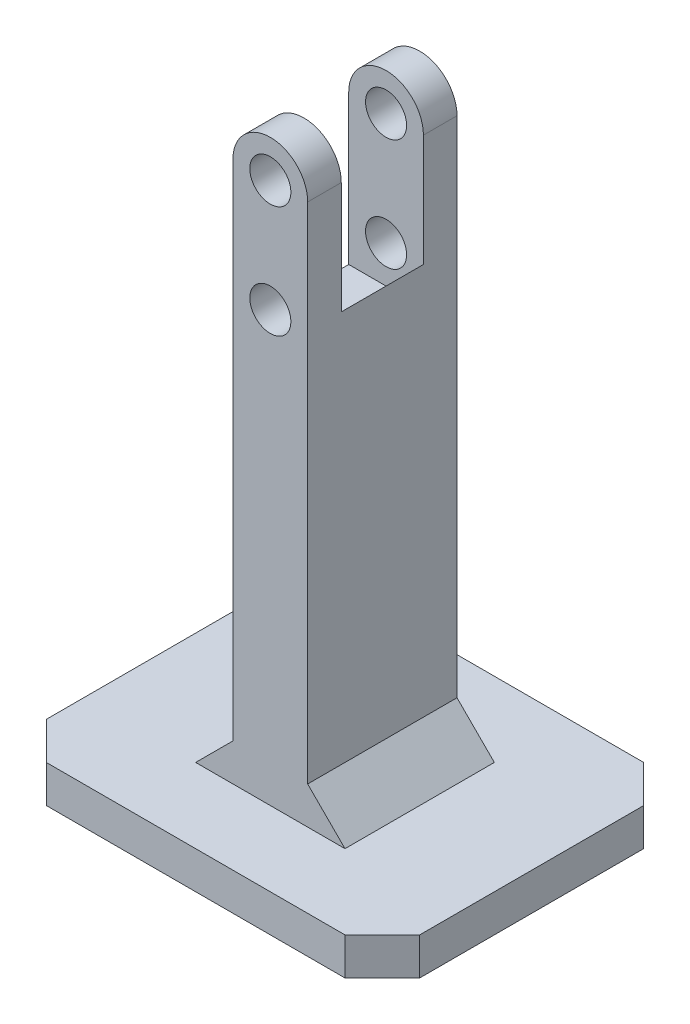
ISO-10303-21;
HEADER;
FILE_DESCRIPTION(('STEP AP214'),'2;1');
FILE_NAME('part.step','',(''),(''),'','','');
FILE_SCHEMA(('AUTOMOTIVE_DESIGN { 1 0 10303 214 1 1 1 1 }'));
ENDSEC;
DATA;
#1=APPLICATION_CONTEXT('core data for automotive mechanical design processes');
#2=APPLICATION_PROTOCOL_DEFINITION('international standard','automotive_design',2000,#1);
#3=PRODUCT_CONTEXT('',#1,'mechanical');
#4=PRODUCT('Part','Part','',(#3));
#5=PRODUCT_RELATED_PRODUCT_CATEGORY('part','',(#4));
#6=PRODUCT_DEFINITION_FORMATION('','',#4);
#7=PRODUCT_DEFINITION_CONTEXT('part definition',#1,'design');
#8=PRODUCT_DEFINITION('design','',#6,#7);
#9=PRODUCT_DEFINITION_SHAPE('','',#8);
#10=(LENGTH_UNIT() NAMED_UNIT(*) SI_UNIT(.MILLI.,.METRE.));
#11=(NAMED_UNIT(*) PLANE_ANGLE_UNIT() SI_UNIT($,.RADIAN.));
#12=(NAMED_UNIT(*) SI_UNIT($,.STERADIAN.) SOLID_ANGLE_UNIT());
#13=UNCERTAINTY_MEASURE_WITH_UNIT(LENGTH_MEASURE(1.E-05),#10,'distance_accuracy_value','');
#14=(GEOMETRIC_REPRESENTATION_CONTEXT(3) GLOBAL_UNCERTAINTY_ASSIGNED_CONTEXT((#13)) GLOBAL_UNIT_ASSIGNED_CONTEXT((#10,
#11,#12)) REPRESENTATION_CONTEXT('',''));
#15=CARTESIAN_POINT('',(0.,0.,0.));
#16=DIRECTION('',(0.,0.,1.));
#17=DIRECTION('',(1.,0.,0.));
#18=AXIS2_PLACEMENT_3D('',#15,#16,#17);
#19=CARTESIAN_POINT('',(5.,0.,10.));
#20=DIRECTION('',(-1.,0.,0.));
#21=DIRECTION('',(0.,-1.,0.));
#22=AXIS2_PLACEMENT_3D('',#19,#20,#21);
#23=PLANE('',#22);
#24=DIRECTION('',(0.,1.,0.));
#25=VECTOR('',#24,1.);
#26=CARTESIAN_POINT('',(5.,0.,10.));
#27=LINE('',#26,#25);
#28=CARTESIAN_POINT('',(5.,-60.,10.));
#29=VERTEX_POINT('',#28);
#30=CARTESIAN_POINT('',(5.,7.5,10.));
#31=VERTEX_POINT('',#30);
#32=EDGE_CURVE('E248',#29,#31,#27,.T.);
#33=ORIENTED_EDGE('',*,*,#32,.F.);
#34=DIRECTION('',(0.,0.,-1.));
#35=VECTOR('',#34,1.);
#36=CARTESIAN_POINT('',(5.,-60.,10.));
#37=LINE('',#36,#35);
#38=CARTESIAN_POINT('',(5.,-60.,-10.));
#39=VERTEX_POINT('',#38);
#40=EDGE_CURVE('E287',#29,#39,#37,.T.);
#41=ORIENTED_EDGE('',*,*,#40,.T.);
#42=DIRECTION('',(0.,1.,0.));
#43=VECTOR('',#42,1.);
#44=CARTESIAN_POINT('',(5.,0.,-10.));
#45=LINE('',#44,#43);
#46=CARTESIAN_POINT('',(5.,7.5,-10.));
#47=VERTEX_POINT('',#46);
#48=EDGE_CURVE('E247',#39,#47,#45,.T.);
#49=ORIENTED_EDGE('',*,*,#48,.T.);
#50=DIRECTION('',(0.,0.,-1.));
#51=VECTOR('',#50,1.);
#52=CARTESIAN_POINT('',(5.,7.5,10.));
#53=LINE('',#52,#51);
#54=CARTESIAN_POINT('',(5.,7.5,-5.5));
#55=VERTEX_POINT('',#54);
#56=EDGE_CURVE('E203',#55,#47,#53,.T.);
#57=ORIENTED_EDGE('',*,*,#56,.F.);
#58=DIRECTION('',(0.,1.,0.));
#59=VECTOR('',#58,1.);
#60=CARTESIAN_POINT('',(5.,0.,-5.5));
#61=LINE('',#60,#59);
#62=CARTESIAN_POINT('',(5.,-7.5,-5.5));
#63=VERTEX_POINT('',#62);
#64=EDGE_CURVE('E195',#63,#55,#61,.T.);
#65=ORIENTED_EDGE('',*,*,#64,.F.);
#66=DIRECTION('',(0.,0.,1.));
#67=VECTOR('',#66,1.);
#68=CARTESIAN_POINT('',(5.,-7.5,-5.5));
#69=LINE('',#68,#67);
#70=CARTESIAN_POINT('',(5.,-7.5,5.5));
#71=VERTEX_POINT('',#70);
#72=EDGE_CURVE('E177',#63,#71,#69,.T.);
#73=ORIENTED_EDGE('',*,*,#72,.T.);
#74=DIRECTION('',(0.,1.,0.));
#75=VECTOR('',#74,1.);
#76=CARTESIAN_POINT('',(5.,0.,5.5));
#77=LINE('',#76,#75);
#78=CARTESIAN_POINT('',(5.,7.5,5.5));
#79=VERTEX_POINT('',#78);
#80=EDGE_CURVE('E213',#71,#79,#77,.T.);
#81=ORIENTED_EDGE('',*,*,#80,.T.);
#82=EDGE_CURVE('E278',#31,#79,#53,.T.);
#83=ORIENTED_EDGE('',*,*,#82,.F.);
#84=EDGE_LOOP('',(#33,#41,#49,#57,#65,#73,#81,#83));
#85=FACE_BOUND('',#84,.T.);
#86=ADVANCED_FACE('F43',(#85),#23,.F.);
#87=CARTESIAN_POINT('',(0.,7.5,10.));
#88=DIRECTION('',(0.,0.,-1.));
#89=DIRECTION('',(-1.,0.,0.));
#90=AXIS2_PLACEMENT_3D('',#87,#88,#89);
#91=CYLINDRICAL_SURFACE('',#90,5.);
#92=CARTESIAN_POINT('',(0.,7.5,-5.5));
#93=DIRECTION('',(0.,0.,1.));
#94=DIRECTION('',(1.,0.,0.));
#95=AXIS2_PLACEMENT_3D('',#92,#93,#94);
#96=CIRCLE('',#95,5.);
#97=CARTESIAN_POINT('',(-5.,7.5,-5.5));
#98=VERTEX_POINT('',#97);
#99=EDGE_CURVE('E204',#55,#98,#96,.T.);
#100=ORIENTED_EDGE('',*,*,#99,.F.);
#101=ORIENTED_EDGE('',*,*,#56,.T.);
#102=CARTESIAN_POINT('',(0.,7.5,-10.));
#103=DIRECTION('',(0.,0.,1.));
#104=DIRECTION('',(1.,0.,0.));
#105=AXIS2_PLACEMENT_3D('',#102,#103,#104);
#106=CIRCLE('',#105,5.);
#107=CARTESIAN_POINT('',(-5.,7.5,-10.));
#108=VERTEX_POINT('',#107);
#109=EDGE_CURVE('E258',#47,#108,#106,.T.);
#110=ORIENTED_EDGE('',*,*,#109,.T.);
#111=DIRECTION('',(0.,0.,-1.));
#112=VECTOR('',#111,1.);
#113=CARTESIAN_POINT('',(-5.,7.5,10.));
#114=LINE('',#113,#112);
#115=EDGE_CURVE('E274',#98,#108,#114,.T.);
#116=ORIENTED_EDGE('',*,*,#115,.F.);
#117=EDGE_LOOP('',(#100,#101,#110,#116));
#118=FACE_BOUND('',#117,.T.);
#119=ADVANCED_FACE('F369',(#118),#91,.T.);
#120=CARTESIAN_POINT('',(-5.,0.,10.));
#121=DIRECTION('',(1.,0.,0.));
#122=DIRECTION('',(0.,1.,0.));
#123=AXIS2_PLACEMENT_3D('',#120,#121,#122);
#124=PLANE('',#123);
#125=DIRECTION('',(0.,-1.,0.));
#126=VECTOR('',#125,1.);
#127=CARTESIAN_POINT('',(-5.,0.,-10.));
#128=LINE('',#127,#126);
#129=CARTESIAN_POINT('',(-4.99999999999999,-60.,-10.));
#130=VERTEX_POINT('',#129);
#131=EDGE_CURVE('E251',#108,#130,#128,.T.);
#132=ORIENTED_EDGE('',*,*,#131,.T.);
#133=DIRECTION('',(0.,0.,1.));
#134=VECTOR('',#133,1.);
#135=CARTESIAN_POINT('',(-4.99999999999999,-60.,10.));
#136=LINE('',#135,#134);
#137=CARTESIAN_POINT('',(-4.99999999999999,-60.,10.));
#138=VERTEX_POINT('',#137);
#139=EDGE_CURVE('E304',#130,#138,#136,.T.);
#140=ORIENTED_EDGE('',*,*,#139,.T.);
#141=DIRECTION('',(0.,-1.,0.));
#142=VECTOR('',#141,1.);
#143=CARTESIAN_POINT('',(-5.,0.,10.));
#144=LINE('',#143,#142);
#145=CARTESIAN_POINT('',(-5.,7.5,10.));
#146=VERTEX_POINT('',#145);
#147=EDGE_CURVE('E253',#146,#138,#144,.T.);
#148=ORIENTED_EDGE('',*,*,#147,.F.);
#149=CARTESIAN_POINT('',(-5.,7.5,5.5));
#150=VERTEX_POINT('',#149);
#151=EDGE_CURVE('E275',#146,#150,#114,.T.);
#152=ORIENTED_EDGE('',*,*,#151,.T.);
#153=DIRECTION('',(0.,-1.,0.));
#154=VECTOR('',#153,1.);
#155=CARTESIAN_POINT('',(-5.,0.,5.5));
#156=LINE('',#155,#154);
#157=CARTESIAN_POINT('',(-5.,-12.5,5.5));
#158=VERTEX_POINT('',#157);
#159=EDGE_CURVE('E219',#150,#158,#156,.T.);
#160=ORIENTED_EDGE('',*,*,#159,.T.);
#161=DIRECTION('',(0.,0.,1.));
#162=VECTOR('',#161,1.);
#163=CARTESIAN_POINT('',(-5.,-12.5,-5.5));
#164=LINE('',#163,#162);
#165=CARTESIAN_POINT('',(-5.,-12.5,-5.5));
#166=VERTEX_POINT('',#165);
#167=EDGE_CURVE('E189',#166,#158,#164,.T.);
#168=ORIENTED_EDGE('',*,*,#167,.F.);
#169=DIRECTION('',(0.,-1.,0.));
#170=VECTOR('',#169,1.);
#171=CARTESIAN_POINT('',(-5.,0.,-5.5));
#172=LINE('',#171,#170);
#173=EDGE_CURVE('E206',#98,#166,#172,.T.);
#174=ORIENTED_EDGE('',*,*,#173,.F.);
#175=ORIENTED_EDGE('',*,*,#115,.T.);
#176=EDGE_LOOP('',(#132,#140,#148,#152,#160,#168,#174,#175));
#177=FACE_BOUND('',#176,.T.);
#178=ADVANCED_FACE('F345',(#177),#124,.F.);
#179=CARTESIAN_POINT('',(0.,-7.5,10.));
#180=DIRECTION('',(0.,0.,1.));
#181=DIRECTION('',(1.,0.,0.));
#182=AXIS2_PLACEMENT_3D('',#179,#180,#181);
#183=CYLINDRICAL_SURFACE('',#182,2.75);
#184=CARTESIAN_POINT('',(0.,-7.5,-10.));
#185=DIRECTION('',(0.,0.,1.));
#186=DIRECTION('',(1.,0.,0.));
#187=AXIS2_PLACEMENT_3D('',#184,#185,#186);
#188=CIRCLE('',#187,2.75);
#189=CARTESIAN_POINT('',(2.75,-7.5,-10.));
#190=VERTEX_POINT('',#189);
#191=EDGE_CURVE('E244',#190,#190,#188,.T.);
#192=ORIENTED_EDGE('',*,*,#191,.F.);
#193=EDGE_LOOP('',(#192));
#194=FACE_BOUND('',#193,.T.);
#195=CARTESIAN_POINT('',(0.,-7.5,-5.5));
#196=DIRECTION('',(0.,0.,1.));
#197=DIRECTION('',(1.,0.,0.));
#198=AXIS2_PLACEMENT_3D('',#195,#196,#197);
#199=CIRCLE('',#198,2.75);
#200=CARTESIAN_POINT('',(2.75,-7.5,-5.5));
#201=VERTEX_POINT('',#200);
#202=EDGE_CURVE('E232',#201,#201,#199,.F.);
#203=ORIENTED_EDGE('',*,*,#202,.F.);
#204=EDGE_LOOP('',(#203));
#205=FACE_BOUND('',#204,.T.);
#206=ADVANCED_FACE('F470',(#194,#205),#183,.F.);
#207=CARTESIAN_POINT('',(0.,7.5,10.));
#208=DIRECTION('',(0.,0.,1.));
#209=DIRECTION('',(1.,0.,0.));
#210=AXIS2_PLACEMENT_3D('',#207,#208,#209);
#211=CYLINDRICAL_SURFACE('',#210,2.75);
#212=CARTESIAN_POINT('',(0.,7.5,-10.));
#213=DIRECTION('',(0.,0.,1.));
#214=DIRECTION('',(1.,0.,0.));
#215=AXIS2_PLACEMENT_3D('',#212,#213,#214);
#216=CIRCLE('',#215,2.75);
#217=CARTESIAN_POINT('',(2.75,7.5,-10.));
#218=VERTEX_POINT('',#217);
#219=EDGE_CURVE('E238',#218,#218,#216,.T.);
#220=ORIENTED_EDGE('',*,*,#219,.F.);
#221=EDGE_LOOP('',(#220));
#222=FACE_BOUND('',#221,.T.);
#223=CARTESIAN_POINT('',(0.,7.5,-5.5));
#224=DIRECTION('',(0.,0.,1.));
#225=DIRECTION('',(1.,0.,0.));
#226=AXIS2_PLACEMENT_3D('',#223,#224,#225);
#227=CIRCLE('',#226,2.75);
#228=CARTESIAN_POINT('',(2.75,7.5,-5.5));
#229=VERTEX_POINT('',#228);
#230=EDGE_CURVE('E231',#229,#229,#227,.F.);
#231=ORIENTED_EDGE('',*,*,#230,.F.);
#232=EDGE_LOOP('',(#231));
#233=FACE_BOUND('',#232,.T.);
#234=ADVANCED_FACE('F468',(#222,#233),#211,.F.);
#235=ORIENTED_EDGE('',*,*,#82,.T.);
#236=CARTESIAN_POINT('',(0.,7.5,5.5));
#237=DIRECTION('',(0.,0.,1.));
#238=DIRECTION('',(1.,0.,0.));
#239=AXIS2_PLACEMENT_3D('',#236,#237,#238);
#240=CIRCLE('',#239,5.);
#241=EDGE_CURVE('E216',#79,#150,#240,.T.);
#242=ORIENTED_EDGE('',*,*,#241,.T.);
#243=ORIENTED_EDGE('',*,*,#151,.F.);
#244=CARTESIAN_POINT('',(0.,7.5,10.));
#245=DIRECTION('',(0.,0.,1.));
#246=DIRECTION('',(1.,0.,0.));
#247=AXIS2_PLACEMENT_3D('',#244,#245,#246);
#248=CIRCLE('',#247,5.);
#249=EDGE_CURVE('E250',#31,#146,#248,.T.);
#250=ORIENTED_EDGE('',*,*,#249,.F.);
#251=EDGE_LOOP('',(#235,#242,#243,#250));
#252=FACE_BOUND('',#251,.T.);
#253=ADVANCED_FACE('F358',(#252),#91,.T.);
#254=CARTESIAN_POINT('',(-24.9999999999999,0.,10.));
#255=DIRECTION('',(1.,0.,0.));
#256=DIRECTION('',(0.,0.,-1.));
#257=AXIS2_PLACEMENT_3D('',#254,#255,#256);
#258=PLANE('',#257);
#259=DIRECTION('',(0.,0.,-1.));
#260=VECTOR('',#259,1.);
#261=CARTESIAN_POINT('',(-24.9999999999999,-65.,10.));
#262=LINE('',#261,#260);
#263=CARTESIAN_POINT('',(-24.9999999999999,-65.,15.));
#264=VERTEX_POINT('',#263);
#265=CARTESIAN_POINT('',(-24.9999999999999,-65.,-15.));
#266=VERTEX_POINT('',#265);
#267=EDGE_CURVE('E271',#264,#266,#262,.T.);
#268=ORIENTED_EDGE('',*,*,#267,.T.);
#269=DIRECTION('',(0.,-1.,0.));
#270=VECTOR('',#269,1.);
#271=CARTESIAN_POINT('',(-24.9999999999999,0.,-15.));
#272=LINE('',#271,#270);
#273=CARTESIAN_POINT('',(-24.9999999999999,-70.,-15.));
#274=VERTEX_POINT('',#273);
#275=EDGE_CURVE('E324',#266,#274,#272,.T.);
#276=ORIENTED_EDGE('',*,*,#275,.T.);
#277=DIRECTION('',(0.,0.,-1.));
#278=VECTOR('',#277,1.);
#279=CARTESIAN_POINT('',(-24.9999999999999,-70.,10.));
#280=LINE('',#279,#278);
#281=CARTESIAN_POINT('',(-24.9999999999999,-70.,15.));
#282=VERTEX_POINT('',#281);
#283=EDGE_CURVE('E268',#282,#274,#280,.T.);
#284=ORIENTED_EDGE('',*,*,#283,.F.);
#285=DIRECTION('',(0.,1.,0.));
#286=VECTOR('',#285,1.);
#287=CARTESIAN_POINT('',(-24.9999999999999,-65.,15.));
#288=LINE('',#287,#286);
#289=EDGE_CURVE('E322',#282,#264,#288,.T.);
#290=ORIENTED_EDGE('',*,*,#289,.T.);
#291=EDGE_LOOP('',(#268,#276,#284,#290));
#292=FACE_BOUND('',#291,.T.);
#293=ADVANCED_FACE('F457',(#292),#258,.F.);
#294=CARTESIAN_POINT('',(0.,-70.,10.));
#295=DIRECTION('',(0.,1.,0.));
#296=DIRECTION('',(-1.,0.,0.));
#297=AXIS2_PLACEMENT_3D('',#294,#295,#296);
#298=PLANE('',#297);
#299=DIRECTION('',(1.,0.,0.));
#300=VECTOR('',#299,1.);
#301=CARTESIAN_POINT('',(0.,-70.,-20.));
#302=LINE('',#301,#300);
#303=CARTESIAN_POINT('',(-19.9999999999999,-70.,-20.));
#304=VERTEX_POINT('',#303);
#305=CARTESIAN_POINT('',(20.0000000000001,-70.,-20.));
#306=VERTEX_POINT('',#305);
#307=EDGE_CURVE('E447',#304,#306,#302,.T.);
#308=ORIENTED_EDGE('',*,*,#307,.T.);
#309=DIRECTION('',(0.707106781186547,0.,0.707106781186548));
#310=VECTOR('',#309,1.);
#311=CARTESIAN_POINT('',(20.,-70.,-20.));
#312=LINE('',#311,#310);
#313=CARTESIAN_POINT('',(25.0000000000001,-70.,-15.));
#314=VERTEX_POINT('',#313);
#315=EDGE_CURVE('E315',#306,#314,#312,.T.);
#316=ORIENTED_EDGE('',*,*,#315,.T.);
#317=DIRECTION('',(0.,0.,-1.));
#318=VECTOR('',#317,1.);
#319=CARTESIAN_POINT('',(25.0000000000001,-70.,10.));
#320=LINE('',#319,#318);
#321=CARTESIAN_POINT('',(25.0000000000001,-70.,15.));
#322=VERTEX_POINT('',#321);
#323=EDGE_CURVE('E265',#322,#314,#320,.T.);
#324=ORIENTED_EDGE('',*,*,#323,.F.);
#325=DIRECTION('',(0.707106781186549,0.,-0.707106781186546));
#326=VECTOR('',#325,1.);
#327=CARTESIAN_POINT('',(25.0000000000001,-70.,15.));
#328=LINE('',#327,#326);
#329=CARTESIAN_POINT('',(20.,-70.,20.));
#330=VERTEX_POINT('',#329);
#331=EDGE_CURVE('E59',#322,#330,#328,.F.);
#332=ORIENTED_EDGE('',*,*,#331,.T.);
#333=DIRECTION('',(1.,0.,0.));
#334=VECTOR('',#333,1.);
#335=CARTESIAN_POINT('',(0.,-70.,20.));
#336=LINE('',#335,#334);
#337=CARTESIAN_POINT('',(-19.9999999999999,-70.,20.));
#338=VERTEX_POINT('',#337);
#339=EDGE_CURVE('E451',#338,#330,#336,.T.);
#340=ORIENTED_EDGE('',*,*,#339,.F.);
#341=DIRECTION('',(-0.707106781186547,0.,-0.707106781186549));
#342=VECTOR('',#341,1.);
#343=CARTESIAN_POINT('',(-19.9999999999999,-70.,20.));
#344=LINE('',#343,#342);
#345=EDGE_CURVE('E67',#338,#282,#344,.T.);
#346=ORIENTED_EDGE('',*,*,#345,.T.);
#347=ORIENTED_EDGE('',*,*,#283,.T.);
#348=DIRECTION('',(-0.707106781186548,0.,0.707106781186547));
#349=VECTOR('',#348,1.);
#350=CARTESIAN_POINT('',(-24.9999999999999,-70.,-15.));
#351=LINE('',#350,#349);
#352=EDGE_CURVE('E313',#274,#304,#351,.F.);
#353=ORIENTED_EDGE('',*,*,#352,.T.);
#354=EDGE_LOOP('',(#308,#316,#324,#332,#340,#346,#347,#353));
#355=FACE_BOUND('',#354,.T.);
#356=ADVANCED_FACE('F454',(#355),#298,.F.);
#357=CARTESIAN_POINT('',(25.,0.,10.));
#358=DIRECTION('',(1.,0.,0.));
#359=DIRECTION('',(0.,1.,0.));
#360=AXIS2_PLACEMENT_3D('',#357,#358,#359);
#361=PLANE('',#360);
#362=ORIENTED_EDGE('',*,*,#323,.T.);
#363=DIRECTION('',(0.,1.,0.));
#364=VECTOR('',#363,1.);
#365=CARTESIAN_POINT('',(25.0000000000001,-65.,-15.));
#366=LINE('',#365,#364);
#367=CARTESIAN_POINT('',(25.0000000000001,-65.,-15.));
#368=VERTEX_POINT('',#367);
#369=EDGE_CURVE('E320',#314,#368,#366,.T.);
#370=ORIENTED_EDGE('',*,*,#369,.T.);
#371=DIRECTION('',(0.,0.,-1.));
#372=VECTOR('',#371,1.);
#373=CARTESIAN_POINT('',(25.0000000000001,-65.,10.));
#374=LINE('',#373,#372);
#375=CARTESIAN_POINT('',(25.0000000000001,-65.,15.));
#376=VERTEX_POINT('',#375);
#377=EDGE_CURVE('E256',#376,#368,#374,.T.);
#378=ORIENTED_EDGE('',*,*,#377,.F.);
#379=DIRECTION('',(0.,-1.,0.));
#380=VECTOR('',#379,1.);
#381=CARTESIAN_POINT('',(25.,0.,15.));
#382=LINE('',#381,#380);
#383=EDGE_CURVE('E317',#376,#322,#382,.T.);
#384=ORIENTED_EDGE('',*,*,#383,.T.);
#385=EDGE_LOOP('',(#362,#370,#378,#384));
#386=FACE_BOUND('',#385,.T.);
#387=ADVANCED_FACE('F437',(#386),#361,.T.);
#388=CARTESIAN_POINT('',(0.,-65.,10.));
#389=DIRECTION('',(0.,1.,0.));
#390=DIRECTION('',(-1.,0.,0.));
#391=AXIS2_PLACEMENT_3D('',#388,#389,#390);
#392=PLANE('',#391);
#393=ORIENTED_EDGE('',*,*,#377,.T.);
#394=DIRECTION('',(-0.707106781186547,0.,-0.707106781186548));
#395=VECTOR('',#394,1.);
#396=CARTESIAN_POINT('',(25.0000000000001,-65.,-15.));
#397=LINE('',#396,#395);
#398=CARTESIAN_POINT('',(20.0000000000001,-65.,-20.));
#399=VERTEX_POINT('',#398);
#400=EDGE_CURVE('E296',#368,#399,#397,.T.);
#401=ORIENTED_EDGE('',*,*,#400,.T.);
#402=DIRECTION('',(1.,0.,0.));
#403=VECTOR('',#402,1.);
#404=CARTESIAN_POINT('',(0.,-65.,-20.));
#405=LINE('',#404,#403);
#406=CARTESIAN_POINT('',(-19.9999999999999,-65.,-20.));
#407=VERTEX_POINT('',#406);
#408=EDGE_CURVE('E442',#407,#399,#405,.T.);
#409=ORIENTED_EDGE('',*,*,#408,.F.);
#410=DIRECTION('',(0.707106781186548,0.,-0.707106781186547));
#411=VECTOR('',#410,1.);
#412=CARTESIAN_POINT('',(-24.9999999999999,-65.,-15.));
#413=LINE('',#412,#411);
#414=EDGE_CURVE('E294',#407,#266,#413,.F.);
#415=ORIENTED_EDGE('',*,*,#414,.T.);
#416=ORIENTED_EDGE('',*,*,#267,.F.);
#417=DIRECTION('',(0.707106781186547,0.,0.707106781186549));
#418=VECTOR('',#417,1.);
#419=CARTESIAN_POINT('',(-15.,-65.,25.));
#420=LINE('',#419,#418);
#421=CARTESIAN_POINT('',(-19.9999999999999,-65.,20.));
#422=VERTEX_POINT('',#421);
#423=EDGE_CURVE('E290',#264,#422,#420,.T.);
#424=ORIENTED_EDGE('',*,*,#423,.T.);
#425=DIRECTION('',(1.,0.,0.));
#426=VECTOR('',#425,1.);
#427=CARTESIAN_POINT('',(0.,-65.,20.));
#428=LINE('',#427,#426);
#429=CARTESIAN_POINT('',(20.,-65.,20.));
#430=VERTEX_POINT('',#429);
#431=EDGE_CURVE('E435',#422,#430,#428,.T.);
#432=ORIENTED_EDGE('',*,*,#431,.T.);
#433=DIRECTION('',(-0.707106781186549,0.,0.707106781186546));
#434=VECTOR('',#433,1.);
#435=CARTESIAN_POINT('',(15.,-65.,25.));
#436=LINE('',#435,#434);
#437=EDGE_CURVE('E292',#430,#376,#436,.F.);
#438=ORIENTED_EDGE('',*,*,#437,.T.);
#439=EDGE_LOOP('',(#393,#401,#409,#415,#416,#424,#432,#438));
#440=FACE_BOUND('',#439,.T.);
#441=DIRECTION('',(-1.,0.,0.));
#442=VECTOR('',#441,1.);
#443=CARTESIAN_POINT('',(0.,-65.,-10.));
#444=LINE('',#443,#442);
#445=CARTESIAN_POINT('',(9.99999999999997,-65.,-10.));
#446=VERTEX_POINT('',#445);
#447=CARTESIAN_POINT('',(-10.0000000000001,-65.,-10.));
#448=VERTEX_POINT('',#447);
#449=EDGE_CURVE('E281',#446,#448,#444,.T.);
#450=ORIENTED_EDGE('',*,*,#449,.F.);
#451=DIRECTION('',(0.,0.,1.));
#452=VECTOR('',#451,1.);
#453=CARTESIAN_POINT('',(9.99999999999997,-65.,10.));
#454=LINE('',#453,#452);
#455=CARTESIAN_POINT('',(9.99999999999997,-65.,10.));
#456=VERTEX_POINT('',#455);
#457=EDGE_CURVE('E301',#446,#456,#454,.T.);
#458=ORIENTED_EDGE('',*,*,#457,.T.);
#459=DIRECTION('',(-1.,0.,0.));
#460=VECTOR('',#459,1.);
#461=CARTESIAN_POINT('',(0.,-65.,10.));
#462=LINE('',#461,#460);
#463=CARTESIAN_POINT('',(-10.0000000000001,-65.,10.));
#464=VERTEX_POINT('',#463);
#465=EDGE_CURVE('E214',#456,#464,#462,.T.);
#466=ORIENTED_EDGE('',*,*,#465,.T.);
#467=DIRECTION('',(0.,0.,-1.));
#468=VECTOR('',#467,1.);
#469=CARTESIAN_POINT('',(-10.0000000000001,-65.,10.));
#470=LINE('',#469,#468);
#471=EDGE_CURVE('E298',#464,#448,#470,.T.);
#472=ORIENTED_EDGE('',*,*,#471,.T.);
#473=EDGE_LOOP('',(#450,#458,#466,#472));
#474=FACE_BOUND('',#473,.T.);
#475=ADVANCED_FACE('F431',(#440,#474),#392,.T.);
#476=CARTESIAN_POINT('',(0.,0.,10.));
#477=DIRECTION('',(0.,0.,1.));
#478=DIRECTION('',(1.,0.,0.));
#479=AXIS2_PLACEMENT_3D('',#476,#477,#478);
#480=PLANE('',#479);
#481=ORIENTED_EDGE('',*,*,#465,.F.);
#482=DIRECTION('',(-0.707106781186545,0.70710678118655,0.));
#483=VECTOR('',#482,1.);
#484=CARTESIAN_POINT('',(5.,-60.,10.));
#485=LINE('',#484,#483);
#486=EDGE_CURVE('E334',#456,#29,#485,.T.);
#487=ORIENTED_EDGE('',*,*,#486,.T.);
#488=ORIENTED_EDGE('',*,*,#32,.T.);
#489=ORIENTED_EDGE('',*,*,#249,.T.);
#490=ORIENTED_EDGE('',*,*,#147,.T.);
#491=DIRECTION('',(-0.707106781186551,-0.707106781186544,0.));
#492=VECTOR('',#491,1.);
#493=CARTESIAN_POINT('',(-10.0000000000001,-65.,10.));
#494=LINE('',#493,#492);
#495=EDGE_CURVE('E11',#138,#464,#494,.T.);
#496=ORIENTED_EDGE('',*,*,#495,.T.);
#497=EDGE_LOOP('',(#481,#487,#488,#489,#490,#496));
#498=FACE_BOUND('',#497,.T.);
#499=CARTESIAN_POINT('',(0.,7.5,10.));
#500=DIRECTION('',(0.,0.,1.));
#501=DIRECTION('',(1.,0.,0.));
#502=AXIS2_PLACEMENT_3D('',#499,#500,#501);
#503=CIRCLE('',#502,2.75);
#504=CARTESIAN_POINT('',(2.75,7.5,10.));
#505=VERTEX_POINT('',#504);
#506=EDGE_CURVE('E235',#505,#505,#503,.T.);
#507=ORIENTED_EDGE('',*,*,#506,.F.);
#508=EDGE_LOOP('',(#507));
#509=FACE_BOUND('',#508,.T.);
#510=CARTESIAN_POINT('',(0.,-7.5,10.));
#511=DIRECTION('',(0.,0.,1.));
#512=DIRECTION('',(1.,0.,0.));
#513=AXIS2_PLACEMENT_3D('',#510,#511,#512);
#514=CIRCLE('',#513,2.75);
#515=CARTESIAN_POINT('',(2.75,-7.5,10.));
#516=VERTEX_POINT('',#515);
#517=EDGE_CURVE('E241',#516,#516,#514,.T.);
#518=ORIENTED_EDGE('',*,*,#517,.F.);
#519=EDGE_LOOP('',(#518));
#520=FACE_BOUND('',#519,.T.);
#521=ADVANCED_FACE('F352',(#498,#509,#520),#480,.T.);
#522=CARTESIAN_POINT('',(0.,0.,-10.));
#523=DIRECTION('',(0.,0.,1.));
#524=DIRECTION('',(1.,0.,0.));
#525=AXIS2_PLACEMENT_3D('',#522,#523,#524);
#526=PLANE('',#525);
#527=ORIENTED_EDGE('',*,*,#219,.T.);
#528=EDGE_LOOP('',(#527));
#529=FACE_BOUND('',#528,.T.);
#530=ORIENTED_EDGE('',*,*,#191,.T.);
#531=EDGE_LOOP('',(#530));
#532=FACE_BOUND('',#531,.T.);
#533=ORIENTED_EDGE('',*,*,#48,.F.);
#534=DIRECTION('',(0.707106781186545,-0.70710678118655,0.));
#535=VECTOR('',#534,1.);
#536=CARTESIAN_POINT('',(-27.5,-27.4999999999998,-10.));
#537=LINE('',#536,#535);
#538=EDGE_CURVE('E331',#39,#446,#537,.T.);
#539=ORIENTED_EDGE('',*,*,#538,.T.);
#540=ORIENTED_EDGE('',*,*,#449,.T.);
#541=DIRECTION('',(0.707106781186551,0.707106781186544,0.));
#542=VECTOR('',#541,1.);
#543=CARTESIAN_POINT('',(27.5,-27.5000000000003,-10.));
#544=LINE('',#543,#542);
#545=EDGE_CURVE('E52',#448,#130,#544,.T.);
#546=ORIENTED_EDGE('',*,*,#545,.T.);
#547=ORIENTED_EDGE('',*,*,#131,.F.);
#548=ORIENTED_EDGE('',*,*,#109,.F.);
#549=EDGE_LOOP('',(#533,#539,#540,#546,#547,#548));
#550=FACE_BOUND('',#549,.T.);
#551=ADVANCED_FACE('F339',(#529,#532,#550),#526,.F.);
#552=CARTESIAN_POINT('',(0.,-7.5,5.5));
#553=DIRECTION('',(0.,0.,1.));
#554=DIRECTION('',(1.,0.,0.));
#555=AXIS2_PLACEMENT_3D('',#552,#553,#554);
#556=CIRCLE('',#555,2.75);
#557=CARTESIAN_POINT('',(2.75,-7.5,5.5));
#558=VERTEX_POINT('',#557);
#559=EDGE_CURVE('E228',#558,#558,#556,.F.);
#560=ORIENTED_EDGE('',*,*,#559,.T.);
#561=EDGE_LOOP('',(#560));
#562=FACE_BOUND('',#561,.T.);
#563=ORIENTED_EDGE('',*,*,#517,.T.);
#564=EDGE_LOOP('',(#563));
#565=FACE_BOUND('',#564,.T.);
#566=ADVANCED_FACE('F476',(#562,#565),#183,.F.);
#567=CARTESIAN_POINT('',(0.,7.5,5.5));
#568=DIRECTION('',(0.,0.,1.));
#569=DIRECTION('',(1.,0.,0.));
#570=AXIS2_PLACEMENT_3D('',#567,#568,#569);
#571=CIRCLE('',#570,2.75);
#572=CARTESIAN_POINT('',(2.75,7.5,5.5));
#573=VERTEX_POINT('',#572);
#574=EDGE_CURVE('E225',#573,#573,#571,.F.);
#575=ORIENTED_EDGE('',*,*,#574,.T.);
#576=EDGE_LOOP('',(#575));
#577=FACE_BOUND('',#576,.T.);
#578=ORIENTED_EDGE('',*,*,#506,.T.);
#579=EDGE_LOOP('',(#578));
#580=FACE_BOUND('',#579,.T.);
#581=ADVANCED_FACE('F482',(#577,#580),#211,.F.);
#582=CARTESIAN_POINT('',(0.,0.,-5.5));
#583=DIRECTION('',(0.,0.,1.));
#584=DIRECTION('',(1.,0.,0.));
#585=AXIS2_PLACEMENT_3D('',#582,#583,#584);
#586=PLANE('',#585);
#587=CARTESIAN_POINT('',(0.,-7.5,-5.5));
#588=DIRECTION('',(0.,0.,1.));
#589=DIRECTION('',(1.,0.,0.));
#590=AXIS2_PLACEMENT_3D('',#587,#588,#589);
#591=CIRCLE('',#590,5.);
#592=CARTESIAN_POINT('',(0.,-12.5,-5.5));
#593=VERTEX_POINT('',#592);
#594=EDGE_CURVE('E181',#63,#593,#591,.F.);
#595=ORIENTED_EDGE('',*,*,#594,.F.);
#596=ORIENTED_EDGE('',*,*,#64,.T.);
#597=ORIENTED_EDGE('',*,*,#99,.T.);
#598=ORIENTED_EDGE('',*,*,#173,.T.);
#599=DIRECTION('',(-1.,0.,0.));
#600=VECTOR('',#599,1.);
#601=CARTESIAN_POINT('',(0.,-12.5,-5.5));
#602=LINE('',#601,#600);
#603=EDGE_CURVE('E190',#593,#166,#602,.T.);
#604=ORIENTED_EDGE('',*,*,#603,.F.);
#605=EDGE_LOOP('',(#595,#596,#597,#598,#604));
#606=FACE_BOUND('',#605,.T.);
#607=ORIENTED_EDGE('',*,*,#230,.T.);
#608=EDGE_LOOP('',(#607));
#609=FACE_BOUND('',#608,.T.);
#610=ORIENTED_EDGE('',*,*,#202,.T.);
#611=EDGE_LOOP('',(#610));
#612=FACE_BOUND('',#611,.T.);
#613=ADVANCED_FACE('F193',(#606,#609,#612),#586,.T.);
#614=CARTESIAN_POINT('',(0.,0.,5.5));
#615=DIRECTION('',(0.,0.,1.));
#616=DIRECTION('',(1.,0.,0.));
#617=AXIS2_PLACEMENT_3D('',#614,#615,#616);
#618=PLANE('',#617);
#619=ORIENTED_EDGE('',*,*,#574,.F.);
#620=EDGE_LOOP('',(#619));
#621=FACE_BOUND('',#620,.T.);
#622=CARTESIAN_POINT('',(0.,-7.5,5.5));
#623=DIRECTION('',(0.,0.,1.));
#624=DIRECTION('',(1.,0.,0.));
#625=AXIS2_PLACEMENT_3D('',#622,#623,#624);
#626=CIRCLE('',#625,5.);
#627=CARTESIAN_POINT('',(0.,-12.5,5.5));
#628=VERTEX_POINT('',#627);
#629=EDGE_CURVE('E184',#71,#628,#626,.F.);
#630=ORIENTED_EDGE('',*,*,#629,.T.);
#631=DIRECTION('',(-1.,0.,0.));
#632=VECTOR('',#631,1.);
#633=CARTESIAN_POINT('',(0.,-12.5,5.5));
#634=LINE('',#633,#632);
#635=EDGE_CURVE('E198',#628,#158,#634,.T.);
#636=ORIENTED_EDGE('',*,*,#635,.T.);
#637=ORIENTED_EDGE('',*,*,#159,.F.);
#638=ORIENTED_EDGE('',*,*,#241,.F.);
#639=ORIENTED_EDGE('',*,*,#80,.F.);
#640=EDGE_LOOP('',(#630,#636,#637,#638,#639));
#641=FACE_BOUND('',#640,.T.);
#642=ORIENTED_EDGE('',*,*,#559,.F.);
#643=EDGE_LOOP('',(#642));
#644=FACE_BOUND('',#643,.T.);
#645=ADVANCED_FACE('F361',(#621,#641,#644),#618,.F.);
#646=CARTESIAN_POINT('',(0.,-7.5,-5.5));
#647=DIRECTION('',(0.,0.,1.));
#648=DIRECTION('',(1.,0.,0.));
#649=AXIS2_PLACEMENT_3D('',#646,#647,#648);
#650=CYLINDRICAL_SURFACE('',#649,5.);
#651=ORIENTED_EDGE('',*,*,#629,.F.);
#652=ORIENTED_EDGE('',*,*,#72,.F.);
#653=ORIENTED_EDGE('',*,*,#594,.T.);
#654=DIRECTION('',(0.,0.,1.));
#655=VECTOR('',#654,1.);
#656=CARTESIAN_POINT('',(0.,-12.5,-5.5));
#657=LINE('',#656,#655);
#658=EDGE_CURVE('E223',#593,#628,#657,.T.);
#659=ORIENTED_EDGE('',*,*,#658,.T.);
#660=EDGE_LOOP('',(#651,#652,#653,#659));
#661=FACE_BOUND('',#660,.T.);
#662=ADVANCED_FACE('F179',(#661),#650,.F.);
#663=CARTESIAN_POINT('',(0.,-12.5,-5.5));
#664=DIRECTION('',(0.,1.,0.));
#665=DIRECTION('',(0.,0.,1.));
#666=AXIS2_PLACEMENT_3D('',#663,#664,#665);
#667=PLANE('',#666);
#668=ORIENTED_EDGE('',*,*,#635,.F.);
#669=ORIENTED_EDGE('',*,*,#658,.F.);
#670=ORIENTED_EDGE('',*,*,#603,.T.);
#671=ORIENTED_EDGE('',*,*,#167,.T.);
#672=EDGE_LOOP('',(#668,#669,#670,#671));
#673=FACE_BOUND('',#672,.T.);
#674=ADVANCED_FACE('F371',(#673),#667,.T.);
#675=CARTESIAN_POINT('',(0.,0.,-20.));
#676=DIRECTION('',(0.,0.,1.));
#677=DIRECTION('',(1.,0.,0.));
#678=AXIS2_PLACEMENT_3D('',#675,#676,#677);
#679=PLANE('',#678);
#680=ORIENTED_EDGE('',*,*,#408,.T.);
#681=DIRECTION('',(0.,-1.,0.));
#682=VECTOR('',#681,1.);
#683=CARTESIAN_POINT('',(20.0000000000001,-70.,-20.));
#684=LINE('',#683,#682);
#685=EDGE_CURVE('E308',#399,#306,#684,.T.);
#686=ORIENTED_EDGE('',*,*,#685,.T.);
#687=ORIENTED_EDGE('',*,*,#307,.F.);
#688=DIRECTION('',(0.,1.,0.));
#689=VECTOR('',#688,1.);
#690=CARTESIAN_POINT('',(-19.9999999999999,0.,-20.));
#691=LINE('',#690,#689);
#692=EDGE_CURVE('E306',#304,#407,#691,.T.);
#693=ORIENTED_EDGE('',*,*,#692,.T.);
#694=EDGE_LOOP('',(#680,#686,#687,#693));
#695=FACE_BOUND('',#694,.T.);
#696=ADVANCED_FACE('F373',(#695),#679,.F.);
#697=CARTESIAN_POINT('',(0.,0.,20.));
#698=DIRECTION('',(0.,0.,1.));
#699=DIRECTION('',(1.,0.,0.));
#700=AXIS2_PLACEMENT_3D('',#697,#698,#699);
#701=PLANE('',#700);
#702=ORIENTED_EDGE('',*,*,#339,.T.);
#703=DIRECTION('',(0.,1.,0.));
#704=VECTOR('',#703,1.);
#705=CARTESIAN_POINT('',(20.,0.,20.));
#706=LINE('',#705,#704);
#707=EDGE_CURVE('E329',#330,#430,#706,.T.);
#708=ORIENTED_EDGE('',*,*,#707,.T.);
#709=ORIENTED_EDGE('',*,*,#431,.F.);
#710=DIRECTION('',(0.,-1.,0.));
#711=VECTOR('',#710,1.);
#712=CARTESIAN_POINT('',(-19.9999999999999,-70.,20.));
#713=LINE('',#712,#711);
#714=EDGE_CURVE('E327',#422,#338,#713,.T.);
#715=ORIENTED_EDGE('',*,*,#714,.T.);
#716=EDGE_LOOP('',(#702,#708,#709,#715));
#717=FACE_BOUND('',#716,.T.);
#718=ADVANCED_FACE('F380',(#717),#701,.T.);
#719=CARTESIAN_POINT('',(5.,-60.,10.));
#720=DIRECTION('',(-0.70710678118655,-0.707106781186545,0.));
#721=DIRECTION('',(0.,0.,-1.));
#722=AXIS2_PLACEMENT_3D('',#719,#720,#721);
#723=PLANE('',#722);
#724=ORIENTED_EDGE('',*,*,#486,.F.);
#725=ORIENTED_EDGE('',*,*,#457,.F.);
#726=ORIENTED_EDGE('',*,*,#538,.F.);
#727=ORIENTED_EDGE('',*,*,#40,.F.);
#728=EDGE_LOOP('',(#724,#725,#726,#727));
#729=FACE_BOUND('',#728,.T.);
#730=ADVANCED_FACE('F366',(#729),#723,.F.);
#731=CARTESIAN_POINT('',(-10.0000000000001,-65.,10.));
#732=DIRECTION('',(0.707106781186544,-0.707106781186551,0.));
#733=DIRECTION('',(0.,0.,-1.));
#734=AXIS2_PLACEMENT_3D('',#731,#732,#733);
#735=PLANE('',#734);
#736=ORIENTED_EDGE('',*,*,#495,.F.);
#737=ORIENTED_EDGE('',*,*,#139,.F.);
#738=ORIENTED_EDGE('',*,*,#545,.F.);
#739=ORIENTED_EDGE('',*,*,#471,.F.);
#740=EDGE_LOOP('',(#736,#737,#738,#739));
#741=FACE_BOUND('',#740,.T.);
#742=ADVANCED_FACE('F350',(#741),#735,.F.);
#743=CARTESIAN_POINT('',(20.,0.,-20.));
#744=DIRECTION('',(0.707106781186548,0.,-0.707106781186547));
#745=DIRECTION('',(0.,1.,0.));
#746=AXIS2_PLACEMENT_3D('',#743,#744,#745);
#747=PLANE('',#746);
#748=ORIENTED_EDGE('',*,*,#400,.F.);
#749=ORIENTED_EDGE('',*,*,#369,.F.);
#750=ORIENTED_EDGE('',*,*,#315,.F.);
#751=ORIENTED_EDGE('',*,*,#685,.F.);
#752=EDGE_LOOP('',(#748,#749,#750,#751));
#753=FACE_BOUND('',#752,.T.);
#754=ADVANCED_FACE('F404',(#753),#747,.T.);
#755=CARTESIAN_POINT('',(-24.9999999999999,0.,-15.));
#756=DIRECTION('',(0.707106781186547,0.,0.707106781186548));
#757=DIRECTION('',(0.,-1.,0.));
#758=AXIS2_PLACEMENT_3D('',#755,#756,#757);
#759=PLANE('',#758);
#760=ORIENTED_EDGE('',*,*,#414,.F.);
#761=ORIENTED_EDGE('',*,*,#692,.F.);
#762=ORIENTED_EDGE('',*,*,#352,.F.);
#763=ORIENTED_EDGE('',*,*,#275,.F.);
#764=EDGE_LOOP('',(#760,#761,#762,#763));
#765=FACE_BOUND('',#764,.T.);
#766=ADVANCED_FACE('F410',(#765),#759,.F.);
#767=CARTESIAN_POINT('',(25.,0.,15.));
#768=DIRECTION('',(-0.707106781186546,0.,-0.707106781186549));
#769=DIRECTION('',(0.,-1.,0.));
#770=AXIS2_PLACEMENT_3D('',#767,#768,#769);
#771=PLANE('',#770);
#772=ORIENTED_EDGE('',*,*,#437,.F.);
#773=ORIENTED_EDGE('',*,*,#707,.F.);
#774=ORIENTED_EDGE('',*,*,#331,.F.);
#775=ORIENTED_EDGE('',*,*,#383,.F.);
#776=EDGE_LOOP('',(#772,#773,#774,#775));
#777=FACE_BOUND('',#776,.T.);
#778=ADVANCED_FACE('F416',(#777),#771,.F.);
#779=CARTESIAN_POINT('',(-19.9999999999999,0.,20.));
#780=DIRECTION('',(-0.707106781186548,0.,0.707106781186546));
#781=DIRECTION('',(0.,1.,0.));
#782=AXIS2_PLACEMENT_3D('',#779,#780,#781);
#783=PLANE('',#782);
#784=ORIENTED_EDGE('',*,*,#423,.F.);
#785=ORIENTED_EDGE('',*,*,#289,.F.);
#786=ORIENTED_EDGE('',*,*,#345,.F.);
#787=ORIENTED_EDGE('',*,*,#714,.F.);
#788=EDGE_LOOP('',(#784,#785,#786,#787));
#789=FACE_BOUND('',#788,.T.);
#790=ADVANCED_FACE('F46',(#789),#783,.T.);
#791=CLOSED_SHELL('',(#86,#119,#178,#206,#234,#253,#293,#356,#387,#475,#521,#551,#566,#581,#613,
#645,#662,#674,#696,#718,#730,#742,#754,#766,#778,#790));
#792=MANIFOLD_SOLID_BREP('B2',#791);
#793=ADVANCED_BREP_SHAPE_REPRESENTATION('',(#18,#792),#14);
#794=SHAPE_DEFINITION_REPRESENTATION(#9,#793);
ENDSEC;
END-ISO-10303-21;
